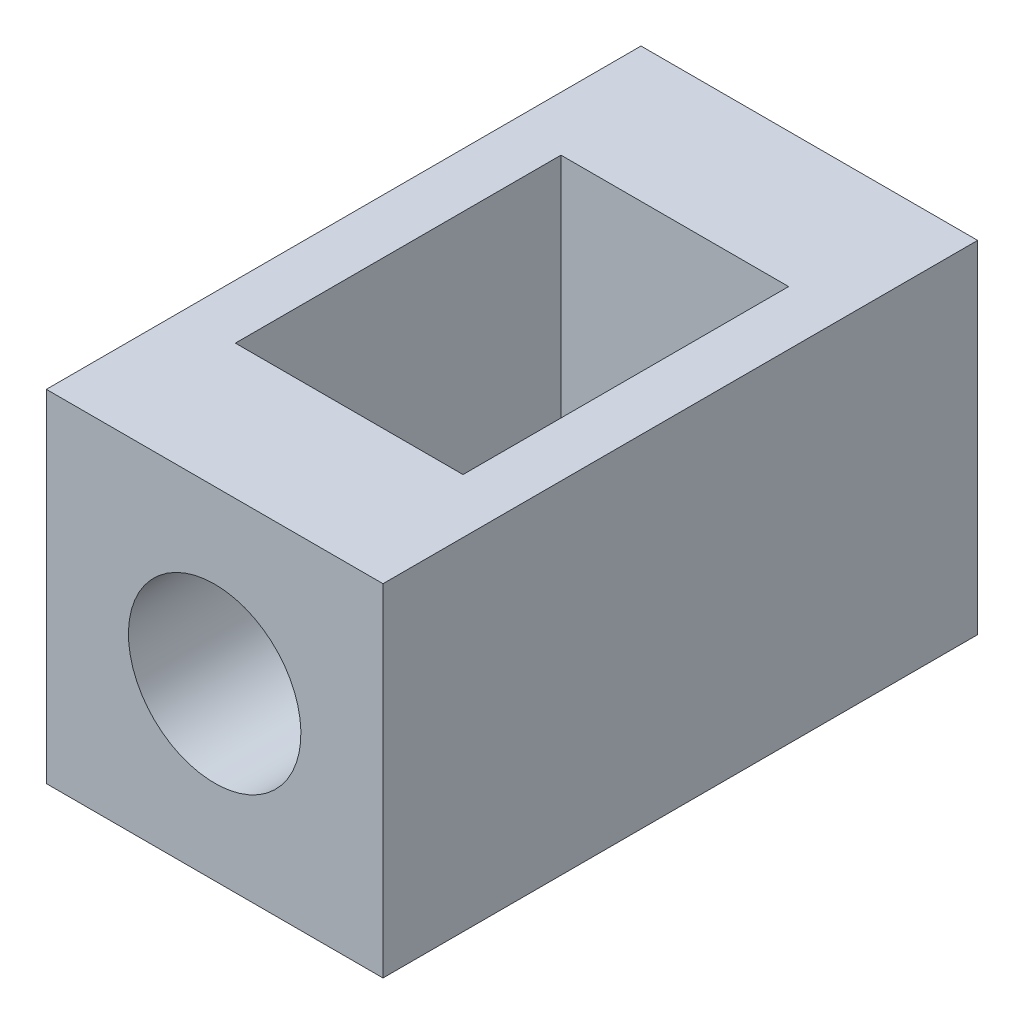
ISO-10303-21;
HEADER;
FILE_DESCRIPTION(('STEP AP214'),'2;1');
FILE_NAME('part.step','',(''),(''),'','','');
FILE_SCHEMA(('AUTOMOTIVE_DESIGN { 1 0 10303 214 1 1 1 1 }'));
ENDSEC;
DATA;
#1=APPLICATION_CONTEXT('core data for automotive mechanical design processes');
#2=APPLICATION_PROTOCOL_DEFINITION('international standard','automotive_design',2000,#1);
#3=PRODUCT_CONTEXT('',#1,'mechanical');
#4=PRODUCT('Part','Part','',(#3));
#5=PRODUCT_RELATED_PRODUCT_CATEGORY('part','',(#4));
#6=PRODUCT_DEFINITION_FORMATION('','',#4);
#7=PRODUCT_DEFINITION_CONTEXT('part definition',#1,'design');
#8=PRODUCT_DEFINITION('design','',#6,#7);
#9=PRODUCT_DEFINITION_SHAPE('','',#8);
#10=(LENGTH_UNIT() NAMED_UNIT(*) SI_UNIT(.MILLI.,.METRE.));
#11=(NAMED_UNIT(*) PLANE_ANGLE_UNIT() SI_UNIT($,.RADIAN.));
#12=(NAMED_UNIT(*) SI_UNIT($,.STERADIAN.) SOLID_ANGLE_UNIT());
#13=UNCERTAINTY_MEASURE_WITH_UNIT(LENGTH_MEASURE(1.E-05),#10,'distance_accuracy_value','');
#14=(GEOMETRIC_REPRESENTATION_CONTEXT(3) GLOBAL_UNCERTAINTY_ASSIGNED_CONTEXT((#13)) GLOBAL_UNIT_ASSIGNED_CONTEXT((#10,
#11,#12)) REPRESENTATION_CONTEXT('',''));
#15=CARTESIAN_POINT('',(0.,0.,0.));
#16=DIRECTION('',(0.,0.,1.));
#17=DIRECTION('',(1.,0.,0.));
#18=AXIS2_PLACEMENT_3D('',#15,#16,#17);
#19=CARTESIAN_POINT('',(-15.2278019032069,-23.3190317123685,14.495));
#20=DIRECTION('',(0.,0.,1.));
#21=DIRECTION('',(3.01991605000675E-07,0.999999999999954,0.));
#22=AXIS2_PLACEMENT_3D('',#19,#20,#21);
#23=CYLINDRICAL_SURFACE('',#22,1.25);
#24=CARTESIAN_POINT('',(-15.2278019032069,-23.3190317123687,12.545));
#25=DIRECTION('',(0.,0.,1.));
#26=DIRECTION('',(3.01991605000675E-07,0.999999999999954,0.));
#27=AXIS2_PLACEMENT_3D('',#24,#25,#26);
#28=CIRCLE('',#27,1.25);
#29=CARTESIAN_POINT('',(-15.2278015257173,-22.0690317123688,12.545));
#30=VERTEX_POINT('',#29);
#31=EDGE_CURVE('E20',#30,#30,#28,.T.);
#32=ORIENTED_EDGE('',*,*,#31,.F.);
#33=EDGE_LOOP('',(#32));
#34=FACE_BOUND('',#33,.T.);
#35=CARTESIAN_POINT('',(-15.2278019032069,-23.3190317123685,14.495));
#36=DIRECTION('',(0.,0.,1.));
#37=DIRECTION('',(3.01991605000675E-07,0.999999999999954,0.));
#38=AXIS2_PLACEMENT_3D('',#35,#36,#37);
#39=CIRCLE('',#38,1.25);
#40=CARTESIAN_POINT('',(-15.2278015257173,-22.0690317123686,14.495));
#41=VERTEX_POINT('',#40);
#42=EDGE_CURVE('E11',#41,#41,#39,.T.);
#43=ORIENTED_EDGE('',*,*,#42,.T.);
#44=EDGE_LOOP('',(#43));
#45=FACE_BOUND('',#44,.T.);
#46=ADVANCED_FACE('F17',(#34,#45),#23,.F.);
#47=CARTESIAN_POINT('',(-12.7878026506368,-25.7940324492283,14.4950000000002));
#48=DIRECTION('',(-0.999999999999954,3.01991605000676E-07,0.));
#49=DIRECTION('',(3.01991605000675E-07,0.999999999999954,0.));
#50=AXIS2_PLACEMENT_3D('',#47,#48,#49);
#51=PLANE('',#50);
#52=DIRECTION('',(0.,0.,1.));
#53=VECTOR('',#52,1.);
#54=CARTESIAN_POINT('',(-12.7878011557778,-20.8440324492285,14.4950000000001));
#55=LINE('',#54,#53);
#56=CARTESIAN_POINT('',(-12.7878011557778,-20.8440324492288,5.87500000000016));
#57=VERTEX_POINT('',#56);
#58=CARTESIAN_POINT('',(-12.7878011557778,-20.8440324492285,14.4950000000001));
#59=VERTEX_POINT('',#58);
#60=EDGE_CURVE('E171',#57,#59,#55,.T.);
#61=ORIENTED_EDGE('',*,*,#60,.T.);
#62=DIRECTION('',(3.01991605000675E-07,0.999999999999954,0.));
#63=VECTOR('',#62,1.);
#64=CARTESIAN_POINT('',(-12.7878026506368,-25.7940324492283,14.4950000000002));
#65=LINE('',#64,#63);
#66=CARTESIAN_POINT('',(-12.7878026506368,-25.7940324492283,14.4950000000002));
#67=VERTEX_POINT('',#66);
#68=EDGE_CURVE('E27',#67,#59,#65,.T.);
#69=ORIENTED_EDGE('',*,*,#68,.F.);
#70=DIRECTION('',(0.,0.,1.));
#71=VECTOR('',#70,1.);
#72=CARTESIAN_POINT('',(-12.7878026506368,-25.7940324492283,14.4950000000002));
#73=LINE('',#72,#71);
#74=CARTESIAN_POINT('',(-12.7878026506368,-25.7940324492283,5.87500000000013));
#75=VERTEX_POINT('',#74);
#76=EDGE_CURVE('E224',#75,#67,#73,.T.);
#77=ORIENTED_EDGE('',*,*,#76,.F.);
#78=DIRECTION('',(3.01991605000675E-07,0.999999999999954,0.));
#79=VECTOR('',#78,1.);
#80=CARTESIAN_POINT('',(-12.7878026506368,-25.7940324492283,5.87500000000013));
#81=LINE('',#80,#79);
#82=EDGE_CURVE('E73',#75,#57,#81,.T.);
#83=ORIENTED_EDGE('',*,*,#82,.T.);
#84=EDGE_LOOP('',(#61,#69,#77,#83));
#85=FACE_BOUND('',#84,.T.);
#86=ADVANCED_FACE('F282',(#85),#51,.F.);
#87=CARTESIAN_POINT('',(-17.6678026506358,-25.7940309755093,14.495));
#88=DIRECTION('',(0.,0.,-1.));
#89=DIRECTION('',(0.999999999999954,-3.01991605000676E-07,0.));
#90=AXIS2_PLACEMENT_3D('',#87,#88,#89);
#91=PLANE('',#90);
#92=ORIENTED_EDGE('',*,*,#42,.F.);
#93=EDGE_LOOP('',(#92));
#94=FACE_BOUND('',#93,.T.);
#95=DIRECTION('',(-0.999999999999954,3.01991605000676E-07,0.));
#96=VECTOR('',#95,1.);
#97=CARTESIAN_POINT('',(-17.6678011557778,-20.8440309755095,14.495));
#98=LINE('',#97,#96);
#99=CARTESIAN_POINT('',(-17.6678011557778,-20.8440309755095,14.495));
#100=VERTEX_POINT('',#99);
#101=EDGE_CURVE('E208',#59,#100,#98,.T.);
#102=ORIENTED_EDGE('',*,*,#101,.T.);
#103=DIRECTION('',(3.01991605000675E-07,0.999999999999954,0.));
#104=VECTOR('',#103,1.);
#105=CARTESIAN_POINT('',(-17.6678026506358,-25.7940309755093,14.495));
#106=LINE('',#105,#104);
#107=CARTESIAN_POINT('',(-17.6678026506358,-25.7940309755093,14.495));
#108=VERTEX_POINT('',#107);
#109=EDGE_CURVE('E213',#108,#100,#106,.T.);
#110=ORIENTED_EDGE('',*,*,#109,.F.);
#111=DIRECTION('',(-0.999999999999954,3.01991605000676E-07,0.));
#112=VECTOR('',#111,1.);
#113=CARTESIAN_POINT('',(-17.6678026506358,-25.7940309755093,14.495));
#114=LINE('',#113,#112);
#115=EDGE_CURVE('E219',#67,#108,#114,.T.);
#116=ORIENTED_EDGE('',*,*,#115,.F.);
#117=ORIENTED_EDGE('',*,*,#68,.T.);
#118=EDGE_LOOP('',(#102,#110,#116,#117));
#119=FACE_BOUND('',#118,.T.);
#120=ADVANCED_FACE('F285',(#94,#119),#91,.F.);
#121=CARTESIAN_POINT('',(-17.6678026506358,-25.7940309755093,14.495));
#122=DIRECTION('',(0.999999999999954,-3.01991605000676E-07,0.));
#123=DIRECTION('',(-3.01991605000675E-07,-0.999999999999954,0.));
#124=AXIS2_PLACEMENT_3D('',#121,#122,#123);
#125=PLANE('',#124);
#126=DIRECTION('',(0.,0.,-1.));
#127=VECTOR('',#126,1.);
#128=CARTESIAN_POINT('',(-17.6678011557778,-20.8440309755095,14.495));
#129=LINE('',#128,#127);
#130=CARTESIAN_POINT('',(-17.6678011557778,-20.8440309755097,5.8750000000001));
#131=VERTEX_POINT('',#130);
#132=EDGE_CURVE('E196',#100,#131,#129,.T.);
#133=ORIENTED_EDGE('',*,*,#132,.T.);
#134=DIRECTION('',(3.01991605000675E-07,0.999999999999954,0.));
#135=VECTOR('',#134,1.);
#136=CARTESIAN_POINT('',(-17.6678026506358,-25.7940309755092,5.875));
#137=LINE('',#136,#135);
#138=CARTESIAN_POINT('',(-17.6678026506358,-25.7940309755092,5.875));
#139=VERTEX_POINT('',#138);
#140=EDGE_CURVE('E39',#139,#131,#137,.T.);
#141=ORIENTED_EDGE('',*,*,#140,.F.);
#142=DIRECTION('',(0.,0.,-1.));
#143=VECTOR('',#142,1.);
#144=CARTESIAN_POINT('',(-17.6678026506358,-25.7940309755093,14.495));
#145=LINE('',#144,#143);
#146=EDGE_CURVE('E203',#108,#139,#145,.T.);
#147=ORIENTED_EDGE('',*,*,#146,.F.);
#148=ORIENTED_EDGE('',*,*,#109,.T.);
#149=EDGE_LOOP('',(#133,#141,#147,#148));
#150=FACE_BOUND('',#149,.T.);
#151=ADVANCED_FACE('F287',(#150),#125,.F.);
#152=CARTESIAN_POINT('',(-17.6678026506358,-25.7940309755092,5.875));
#153=DIRECTION('',(0.,0.,1.));
#154=DIRECTION('',(-0.999999999999954,3.01991605000676E-07,0.));
#155=AXIS2_PLACEMENT_3D('',#152,#153,#154);
#156=PLANE('',#155);
#157=DIRECTION('',(0.999999999999954,-3.01991605000676E-07,0.));
#158=VECTOR('',#157,1.);
#159=CARTESIAN_POINT('',(-17.6678011557778,-20.8440309755097,5.8750000000001));
#160=LINE('',#159,#158);
#161=EDGE_CURVE('E193',#131,#57,#160,.T.);
#162=ORIENTED_EDGE('',*,*,#161,.T.);
#163=ORIENTED_EDGE('',*,*,#82,.F.);
#164=DIRECTION('',(0.999999999999954,-3.01991605000676E-07,0.));
#165=VECTOR('',#164,1.);
#166=CARTESIAN_POINT('',(-17.6678026506358,-25.7940309755092,5.875));
#167=LINE('',#166,#165);
#168=EDGE_CURVE('E199',#139,#75,#167,.T.);
#169=ORIENTED_EDGE('',*,*,#168,.F.);
#170=ORIENTED_EDGE('',*,*,#140,.T.);
#171=EDGE_LOOP('',(#162,#163,#169,#170));
#172=FACE_BOUND('',#171,.T.);
#173=ADVANCED_FACE('F303',(#172),#156,.F.);
#174=CARTESIAN_POINT('',(-15.2278026506368,-25.7940317123687,10.185));
#175=DIRECTION('',(-3.01991605000675E-07,-0.999999999999954,0.));
#176=DIRECTION('',(-0.999999999999954,3.01991605000676E-07,0.));
#177=AXIS2_PLACEMENT_3D('',#174,#175,#176);
#178=PLANE('',#177);
#179=DIRECTION('',(0.,0.,1.));
#180=VECTOR('',#179,1.);
#181=CARTESIAN_POINT('',(-13.5778026506368,-25.794032210655,10.1850000000001));
#182=LINE('',#181,#180);
#183=CARTESIAN_POINT('',(-13.5778026506368,-25.7940322106548,7.82500000000012));
#184=VERTEX_POINT('',#183);
#185=CARTESIAN_POINT('',(-13.5778026506368,-25.794032210655,12.5450000000001));
#186=VERTEX_POINT('',#185);
#187=EDGE_CURVE('E166',#184,#186,#182,.T.);
#188=ORIENTED_EDGE('',*,*,#187,.F.);
#189=DIRECTION('',(0.999999999999954,-3.01991605000676E-07,0.));
#190=VECTOR('',#189,1.);
#191=CARTESIAN_POINT('',(-15.2278026506368,-25.7940317123687,7.8250000000001));
#192=LINE('',#191,#190);
#193=CARTESIAN_POINT('',(-16.8778026506358,-25.7940312140826,7.825));
#194=VERTEX_POINT('',#193);
#195=EDGE_CURVE('E127',#194,#184,#192,.T.);
#196=ORIENTED_EDGE('',*,*,#195,.F.);
#197=DIRECTION('',(0.,0.,-1.));
#198=VECTOR('',#197,1.);
#199=CARTESIAN_POINT('',(-16.8778026506358,-25.7940312140827,10.185));
#200=LINE('',#199,#198);
#201=CARTESIAN_POINT('',(-16.8778026506358,-25.7940312140826,12.545));
#202=VERTEX_POINT('',#201);
#203=EDGE_CURVE('E151',#202,#194,#200,.T.);
#204=ORIENTED_EDGE('',*,*,#203,.F.);
#205=DIRECTION('',(-0.999999999999954,3.01991605000676E-07,0.));
#206=VECTOR('',#205,1.);
#207=CARTESIAN_POINT('',(-15.2278026506368,-25.7940317123687,12.5450000000001));
#208=LINE('',#207,#206);
#209=EDGE_CURVE('E140',#186,#202,#208,.T.);
#210=ORIENTED_EDGE('',*,*,#209,.F.);
#211=EDGE_LOOP('',(#188,#196,#204,#210));
#212=FACE_BOUND('',#211,.T.);
#213=ORIENTED_EDGE('',*,*,#76,.T.);
#214=ORIENTED_EDGE('',*,*,#115,.T.);
#215=ORIENTED_EDGE('',*,*,#146,.T.);
#216=ORIENTED_EDGE('',*,*,#168,.T.);
#217=EDGE_LOOP('',(#213,#214,#215,#216));
#218=FACE_BOUND('',#217,.T.);
#219=ADVANCED_FACE('F293',(#212,#218),#178,.T.);
#220=CARTESIAN_POINT('',(-15.2278011557778,-20.8440317123687,10.1850000000001));
#221=DIRECTION('',(-3.01991605000675E-07,-0.999999999999954,0.));
#222=DIRECTION('',(-0.999999999999954,3.01991605000676E-07,0.));
#223=AXIS2_PLACEMENT_3D('',#220,#221,#222);
#224=PLANE('',#223);
#225=DIRECTION('',(0.999999999999954,-3.01991605000676E-07,0.));
#226=VECTOR('',#225,1.);
#227=CARTESIAN_POINT('',(-16.8778011557778,-20.8440312140825,7.82500000000011));
#228=LINE('',#227,#226);
#229=CARTESIAN_POINT('',(-16.8778011557778,-20.8440312140825,7.82500000000011));
#230=VERTEX_POINT('',#229);
#231=CARTESIAN_POINT('',(-13.5778011557778,-20.8440322106555,7.82500000000015));
#232=VERTEX_POINT('',#231);
#233=EDGE_CURVE('E161',#230,#232,#228,.T.);
#234=ORIENTED_EDGE('',*,*,#233,.T.);
#235=DIRECTION('',(0.,0.,1.));
#236=VECTOR('',#235,1.);
#237=CARTESIAN_POINT('',(-13.5778011557778,-20.8440322106547,12.545));
#238=LINE('',#237,#236);
#239=CARTESIAN_POINT('',(-13.5778011557778,-20.8440322106547,12.545));
#240=VERTEX_POINT('',#239);
#241=EDGE_CURVE('E84',#232,#240,#238,.T.);
#242=ORIENTED_EDGE('',*,*,#241,.T.);
#243=DIRECTION('',(-0.999999999999954,3.01991605000676E-07,0.));
#244=VECTOR('',#243,1.);
#245=CARTESIAN_POINT('',(-16.8778011557778,-20.8440312140827,12.545));
#246=LINE('',#245,#244);
#247=CARTESIAN_POINT('',(-16.8778011557778,-20.8440312140827,12.545));
#248=VERTEX_POINT('',#247);
#249=EDGE_CURVE('E130',#240,#248,#246,.T.);
#250=ORIENTED_EDGE('',*,*,#249,.T.);
#251=DIRECTION('',(0.,0.,-1.));
#252=VECTOR('',#251,1.);
#253=CARTESIAN_POINT('',(-16.8778011557778,-20.8440312140827,12.545));
#254=LINE('',#253,#252);
#255=EDGE_CURVE('E116',#248,#230,#254,.T.);
#256=ORIENTED_EDGE('',*,*,#255,.T.);
#257=EDGE_LOOP('',(#234,#242,#250,#256));
#258=FACE_BOUND('',#257,.T.);
#259=ORIENTED_EDGE('',*,*,#60,.F.);
#260=ORIENTED_EDGE('',*,*,#161,.F.);
#261=ORIENTED_EDGE('',*,*,#132,.F.);
#262=ORIENTED_EDGE('',*,*,#101,.F.);
#263=EDGE_LOOP('',(#259,#260,#261,#262));
#264=FACE_BOUND('',#263,.T.);
#265=ADVANCED_FACE('F131',(#258,#264),#224,.F.);
#266=CARTESIAN_POINT('',(-13.5778011557778,-20.8440322106547,12.545));
#267=DIRECTION('',(0.999999999999954,-3.01991605000676E-07,0.));
#268=DIRECTION('',(-3.01991605000675E-07,-0.999999999999954,0.));
#269=AXIS2_PLACEMENT_3D('',#266,#267,#268);
#270=PLANE('',#269);
#271=ORIENTED_EDGE('',*,*,#187,.T.);
#272=DIRECTION('',(-3.01991605000675E-07,-0.999999999999954,0.));
#273=VECTOR('',#272,1.);
#274=CARTESIAN_POINT('',(-13.5778011557778,-20.8440322106547,12.545));
#275=LINE('',#274,#273);
#276=EDGE_CURVE('E136',#240,#186,#275,.T.);
#277=ORIENTED_EDGE('',*,*,#276,.F.);
#278=ORIENTED_EDGE('',*,*,#241,.F.);
#279=DIRECTION('',(-3.01991605000675E-07,-0.999999999999954,0.));
#280=VECTOR('',#279,1.);
#281=CARTESIAN_POINT('',(-13.5778011557778,-20.8440322106555,7.82500000000015));
#282=LINE('',#281,#280);
#283=EDGE_CURVE('E158',#232,#184,#282,.T.);
#284=ORIENTED_EDGE('',*,*,#283,.T.);
#285=EDGE_LOOP('',(#271,#277,#278,#284));
#286=FACE_BOUND('',#285,.T.);
#287=ADVANCED_FACE('F312',(#286),#270,.F.);
#288=CARTESIAN_POINT('',(-16.8778011557778,-20.8440312140825,7.82500000000011));
#289=DIRECTION('',(0.,0.,-1.));
#290=DIRECTION('',(-3.01991605000675E-07,-0.999999999999954,0.));
#291=AXIS2_PLACEMENT_3D('',#288,#289,#290);
#292=PLANE('',#291);
#293=ORIENTED_EDGE('',*,*,#195,.T.);
#294=ORIENTED_EDGE('',*,*,#283,.F.);
#295=ORIENTED_EDGE('',*,*,#233,.F.);
#296=DIRECTION('',(-3.01991605000675E-07,-0.999999999999954,0.));
#297=VECTOR('',#296,1.);
#298=CARTESIAN_POINT('',(-16.8778011557778,-20.8440312140825,7.82500000000011));
#299=LINE('',#298,#297);
#300=EDGE_CURVE('E124',#230,#194,#299,.T.);
#301=ORIENTED_EDGE('',*,*,#300,.T.);
#302=EDGE_LOOP('',(#293,#294,#295,#301));
#303=FACE_BOUND('',#302,.T.);
#304=ADVANCED_FACE('F315',(#303),#292,.F.);
#305=CARTESIAN_POINT('',(-16.8778011557778,-20.8440312140827,12.545));
#306=DIRECTION('',(-0.999999999999954,3.01991605000676E-07,0.));
#307=DIRECTION('',(3.01991605000675E-07,0.999999999999954,0.));
#308=AXIS2_PLACEMENT_3D('',#305,#306,#307);
#309=PLANE('',#308);
#310=ORIENTED_EDGE('',*,*,#203,.T.);
#311=ORIENTED_EDGE('',*,*,#300,.F.);
#312=ORIENTED_EDGE('',*,*,#255,.F.);
#313=DIRECTION('',(-3.01991605000675E-07,-0.999999999999954,0.));
#314=VECTOR('',#313,1.);
#315=CARTESIAN_POINT('',(-16.8778011557778,-20.8440312140827,12.545));
#316=LINE('',#315,#314);
#317=EDGE_CURVE('E121',#248,#202,#316,.T.);
#318=ORIENTED_EDGE('',*,*,#317,.T.);
#319=EDGE_LOOP('',(#310,#311,#312,#318));
#320=FACE_BOUND('',#319,.T.);
#321=ADVANCED_FACE('F119',(#320),#309,.F.);
#322=CARTESIAN_POINT('',(-16.8778011557778,-20.8440312140827,12.545));
#323=DIRECTION('',(0.,0.,1.));
#324=DIRECTION('',(3.01991605000675E-07,0.999999999999954,0.));
#325=AXIS2_PLACEMENT_3D('',#322,#323,#324);
#326=PLANE('',#325);
#327=ORIENTED_EDGE('',*,*,#31,.T.);
#328=EDGE_LOOP('',(#327));
#329=FACE_BOUND('',#328,.T.);
#330=ORIENTED_EDGE('',*,*,#209,.T.);
#331=ORIENTED_EDGE('',*,*,#317,.F.);
#332=ORIENTED_EDGE('',*,*,#249,.F.);
#333=ORIENTED_EDGE('',*,*,#276,.T.);
#334=EDGE_LOOP('',(#330,#331,#332,#333));
#335=FACE_BOUND('',#334,.T.);
#336=ADVANCED_FACE('F138',(#329,#335),#326,.F.);
#337=CLOSED_SHELL('',(#46,#86,#120,#151,#173,#219,#265,#287,#304,#321,#336));
#338=MANIFOLD_SOLID_BREP('B1',#337);
#339=ADVANCED_BREP_SHAPE_REPRESENTATION('',(#18,#338),#14);
#340=SHAPE_DEFINITION_REPRESENTATION(#9,#339);
ENDSEC;
END-ISO-10303-21;
